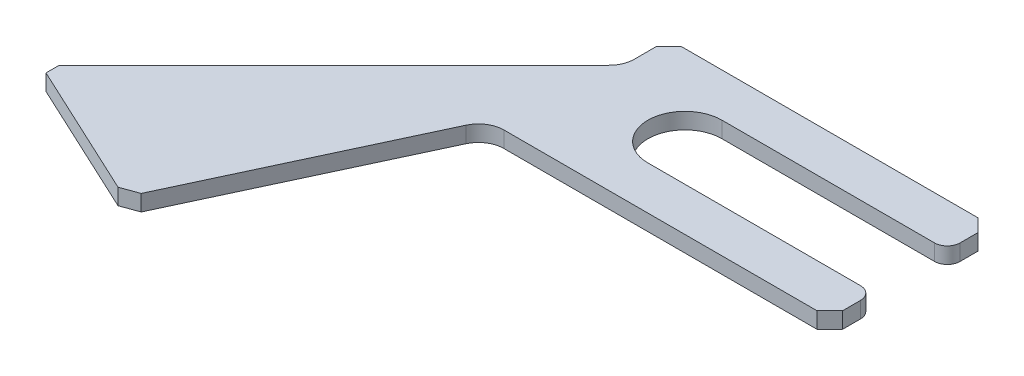
ISO-10303-21;
HEADER;
FILE_DESCRIPTION(('STEP AP214'),'2;1');
FILE_NAME('part.step','',(''),(''),'','','');
FILE_SCHEMA(('AUTOMOTIVE_DESIGN { 1 0 10303 214 1 1 1 1 }'));
ENDSEC;
DATA;
#1=APPLICATION_CONTEXT('core data for automotive mechanical design processes');
#2=APPLICATION_PROTOCOL_DEFINITION('international standard','automotive_design',2000,#1);
#3=PRODUCT_CONTEXT('',#1,'mechanical');
#4=PRODUCT('Part','Part','',(#3));
#5=PRODUCT_RELATED_PRODUCT_CATEGORY('part','',(#4));
#6=PRODUCT_DEFINITION_FORMATION('','',#4);
#7=PRODUCT_DEFINITION_CONTEXT('part definition',#1,'design');
#8=PRODUCT_DEFINITION('design','',#6,#7);
#9=PRODUCT_DEFINITION_SHAPE('','',#8);
#10=(LENGTH_UNIT() NAMED_UNIT(*) SI_UNIT(.MILLI.,.METRE.));
#11=(NAMED_UNIT(*) PLANE_ANGLE_UNIT() SI_UNIT($,.RADIAN.));
#12=(NAMED_UNIT(*) SI_UNIT($,.STERADIAN.) SOLID_ANGLE_UNIT());
#13=UNCERTAINTY_MEASURE_WITH_UNIT(LENGTH_MEASURE(1.E-05),#10,'distance_accuracy_value','');
#14=(GEOMETRIC_REPRESENTATION_CONTEXT(3) GLOBAL_UNCERTAINTY_ASSIGNED_CONTEXT((#13)) GLOBAL_UNIT_ASSIGNED_CONTEXT((#10,
#11,#12)) REPRESENTATION_CONTEXT('',''));
#15=CARTESIAN_POINT('',(0.,0.,0.));
#16=DIRECTION('',(0.,0.,1.));
#17=DIRECTION('',(1.,0.,0.));
#18=AXIS2_PLACEMENT_3D('',#15,#16,#17);
#19=CARTESIAN_POINT('',(9.99999999999994,1.,5.));
#20=DIRECTION('',(-1.,0.,0.));
#21=DIRECTION('',(0.,0.,1.));
#22=AXIS2_PLACEMENT_3D('',#19,#20,#21);
#23=PLANE('',#22);
#24=DIRECTION('',(0.,0.,-1.));
#25=VECTOR('',#24,1.);
#26=CARTESIAN_POINT('',(9.99999999999994,0.,5.));
#27=LINE('',#26,#25);
#28=CARTESIAN_POINT('',(9.99999999999994,0.,-3.09375));
#29=VERTEX_POINT('',#28);
#30=CARTESIAN_POINT('',(9.99999999999994,0.,-4.20625));
#31=VERTEX_POINT('',#30);
#32=EDGE_CURVE('E207',#29,#31,#27,.T.);
#33=ORIENTED_EDGE('',*,*,#32,.T.);
#34=DIRECTION('',(0.,1.,0.));
#35=VECTOR('',#34,1.);
#36=CARTESIAN_POINT('',(9.99999999999994,1.,-4.20625));
#37=LINE('',#36,#35);
#38=CARTESIAN_POINT('',(9.99999999999994,1.,-4.20625));
#39=VERTEX_POINT('',#38);
#40=EDGE_CURVE('E317',#31,#39,#37,.T.);
#41=ORIENTED_EDGE('',*,*,#40,.T.);
#42=DIRECTION('',(0.,0.,-1.));
#43=VECTOR('',#42,1.);
#44=CARTESIAN_POINT('',(9.99999999999994,1.,5.));
#45=LINE('',#44,#43);
#46=CARTESIAN_POINT('',(9.99999999999994,1.,-3.09375));
#47=VERTEX_POINT('',#46);
#48=EDGE_CURVE('E212',#47,#39,#45,.T.);
#49=ORIENTED_EDGE('',*,*,#48,.F.);
#50=DIRECTION('',(0.,1.,0.));
#51=VECTOR('',#50,1.);
#52=CARTESIAN_POINT('',(9.99999999999994,1.,-3.09375));
#53=LINE('',#52,#51);
#54=EDGE_CURVE('E278',#47,#29,#53,.F.);
#55=ORIENTED_EDGE('',*,*,#54,.T.);
#56=EDGE_LOOP('',(#33,#41,#49,#55));
#57=FACE_BOUND('',#56,.T.);
#58=ADVANCED_FACE('F34',(#57),#23,.F.);
#59=CARTESIAN_POINT('',(9.99999999999994,1.,4.20624999999999));
#60=VERTEX_POINT('',#59);
#61=CARTESIAN_POINT('',(9.99999999999994,1.,3.09375));
#62=VERTEX_POINT('',#61);
#63=EDGE_CURVE('E209',#60,#62,#45,.T.);
#64=ORIENTED_EDGE('',*,*,#63,.F.);
#65=DIRECTION('',(0.,-1.,0.));
#66=VECTOR('',#65,1.);
#67=CARTESIAN_POINT('',(9.99999999999994,1.,4.20624999999999));
#68=LINE('',#67,#66);
#69=CARTESIAN_POINT('',(9.99999999999994,0.,4.20624999999999));
#70=VERTEX_POINT('',#69);
#71=EDGE_CURVE('E42',#60,#70,#68,.T.);
#72=ORIENTED_EDGE('',*,*,#71,.T.);
#73=CARTESIAN_POINT('',(9.99999999999994,0.,3.09375));
#74=VERTEX_POINT('',#73);
#75=EDGE_CURVE('E231',#70,#74,#27,.T.);
#76=ORIENTED_EDGE('',*,*,#75,.T.);
#77=DIRECTION('',(0.,1.,0.));
#78=VECTOR('',#77,1.);
#79=CARTESIAN_POINT('',(9.99999999999994,1.,3.09375));
#80=LINE('',#79,#78);
#81=EDGE_CURVE('E263',#74,#62,#80,.T.);
#82=ORIENTED_EDGE('',*,*,#81,.T.);
#83=EDGE_LOOP('',(#64,#72,#76,#82));
#84=FACE_BOUND('',#83,.T.);
#85=ADVANCED_FACE('F323',(#84),#23,.F.);
#86=CARTESIAN_POINT('',(-10.0000000000001,1.,-5.));
#87=DIRECTION('',(0.,0.,1.));
#88=DIRECTION('',(1.,0.,0.));
#89=AXIS2_PLACEMENT_3D('',#86,#87,#88);
#90=PLANE('',#89);
#91=DIRECTION('',(-1.,0.,0.));
#92=VECTOR('',#91,1.);
#93=CARTESIAN_POINT('',(-10.0000000000001,0.,-5.));
#94=LINE('',#93,#92);
#95=CARTESIAN_POINT('',(9.20624999999993,0.,-5.00000000000001));
#96=VERTEX_POINT('',#95);
#97=CARTESIAN_POINT('',(-9.20625000000006,0.,-5.));
#98=VERTEX_POINT('',#97);
#99=EDGE_CURVE('E233',#96,#98,#94,.T.);
#100=ORIENTED_EDGE('',*,*,#99,.T.);
#101=DIRECTION('',(0.,1.,0.));
#102=VECTOR('',#101,1.);
#103=CARTESIAN_POINT('',(-9.20625000000006,1.,-5.));
#104=LINE('',#103,#102);
#105=CARTESIAN_POINT('',(-9.20625000000006,1.,-5.));
#106=VERTEX_POINT('',#105);
#107=EDGE_CURVE('E315',#98,#106,#104,.T.);
#108=ORIENTED_EDGE('',*,*,#107,.T.);
#109=DIRECTION('',(-1.,0.,0.));
#110=VECTOR('',#109,1.);
#111=CARTESIAN_POINT('',(-10.0000000000001,1.,-5.));
#112=LINE('',#111,#110);
#113=CARTESIAN_POINT('',(9.20624999999993,1.,-5.00000000000001));
#114=VERTEX_POINT('',#113);
#115=EDGE_CURVE('E211',#114,#106,#112,.T.);
#116=ORIENTED_EDGE('',*,*,#115,.F.);
#117=DIRECTION('',(0.,-1.,0.));
#118=VECTOR('',#117,1.);
#119=CARTESIAN_POINT('',(9.20624999999994,1.,-5.));
#120=LINE('',#119,#118);
#121=EDGE_CURVE('E312',#114,#96,#120,.T.);
#122=ORIENTED_EDGE('',*,*,#121,.T.);
#123=EDGE_LOOP('',(#100,#108,#116,#122));
#124=FACE_BOUND('',#123,.T.);
#125=ADVANCED_FACE('F345',(#124),#90,.F.);
#126=CARTESIAN_POINT('',(-10.0000000000001,1.,-2.86501184166654));
#127=DIRECTION('',(1.,0.,0.));
#128=DIRECTION('',(0.,0.,-1.));
#129=AXIS2_PLACEMENT_3D('',#126,#127,#128);
#130=PLANE('',#129);
#131=DIRECTION('',(0.,0.,1.));
#132=VECTOR('',#131,1.);
#133=CARTESIAN_POINT('',(-10.0000000000001,1.,-2.86501184166654));
#134=LINE('',#133,#132);
#135=CARTESIAN_POINT('',(-10.0000000000001,1.,-4.20625000000001));
#136=VERTEX_POINT('',#135);
#137=CARTESIAN_POINT('',(-10.0000000000001,1.,-2.86501184166654));
#138=VERTEX_POINT('',#137);
#139=EDGE_CURVE('E215',#136,#138,#134,.T.);
#140=ORIENTED_EDGE('',*,*,#139,.F.);
#141=DIRECTION('',(0.,-1.,0.));
#142=VECTOR('',#141,1.);
#143=CARTESIAN_POINT('',(-10.0000000000001,1.,-4.20625000000001));
#144=LINE('',#143,#142);
#145=CARTESIAN_POINT('',(-10.0000000000001,0.,-4.20625000000001));
#146=VERTEX_POINT('',#145);
#147=EDGE_CURVE('E309',#136,#146,#144,.T.);
#148=ORIENTED_EDGE('',*,*,#147,.T.);
#149=DIRECTION('',(0.,0.,1.));
#150=VECTOR('',#149,1.);
#151=CARTESIAN_POINT('',(-10.0000000000001,0.,-2.86501184166654));
#152=LINE('',#151,#150);
#153=CARTESIAN_POINT('',(-10.0000000000001,0.,-2.86501184166654));
#154=VERTEX_POINT('',#153);
#155=EDGE_CURVE('E236',#146,#154,#152,.T.);
#156=ORIENTED_EDGE('',*,*,#155,.T.);
#157=DIRECTION('',(0.,-1.,0.));
#158=VECTOR('',#157,1.);
#159=CARTESIAN_POINT('',(-10.0000000000001,1.,-2.86501184166654));
#160=LINE('',#159,#158);
#161=EDGE_CURVE('E260',#138,#154,#160,.T.);
#162=ORIENTED_EDGE('',*,*,#161,.F.);
#163=EDGE_LOOP('',(#140,#148,#156,#162));
#164=FACE_BOUND('',#163,.T.);
#165=ADVANCED_FACE('F375',(#164),#130,.F.);
#166=CARTESIAN_POINT('',(-11.5875000000001,1.,-2.86501184166654));
#167=DIRECTION('',(0.,-1.,0.));
#168=DIRECTION('',(0.,0.,-1.));
#169=AXIS2_PLACEMENT_3D('',#166,#167,#168);
#170=CYLINDRICAL_SURFACE('',#169,1.5875);
#171=CARTESIAN_POINT('',(-11.5875000000001,0.,-2.86501184166654));
#172=DIRECTION('',(0.,-1.,0.));
#173=DIRECTION('',(0.,0.,-1.));
#174=AXIS2_PLACEMENT_3D('',#171,#172,#173);
#175=CIRCLE('',#174,1.5875);
#176=CARTESIAN_POINT('',(-10.4649679848664,0.,-1.7424798265329));
#177=VERTEX_POINT('',#176);
#178=EDGE_CURVE('E238',#154,#177,#175,.T.);
#179=ORIENTED_EDGE('',*,*,#178,.T.);
#180=DIRECTION('',(0.,-1.,0.));
#181=VECTOR('',#180,1.);
#182=CARTESIAN_POINT('',(-10.4649679848664,1.,-1.7424798265329));
#183=LINE('',#182,#181);
#184=CARTESIAN_POINT('',(-10.4649679848664,1.,-1.7424798265329));
#185=VERTEX_POINT('',#184);
#186=EDGE_CURVE('E257',#185,#177,#183,.T.);
#187=ORIENTED_EDGE('',*,*,#186,.F.);
#188=CARTESIAN_POINT('',(-11.5875000000001,1.,-2.86501184166654));
#189=DIRECTION('',(0.,-1.,0.));
#190=DIRECTION('',(0.,0.,-1.));
#191=AXIS2_PLACEMENT_3D('',#188,#189,#190);
#192=CIRCLE('',#191,1.5875);
#193=EDGE_CURVE('E217',#138,#185,#192,.T.);
#194=ORIENTED_EDGE('',*,*,#193,.F.);
#195=ORIENTED_EDGE('',*,*,#161,.T.);
#196=EDGE_LOOP('',(#179,#187,#194,#195));
#197=FACE_BOUND('',#196,.T.);
#198=ADVANCED_FACE('F381',(#197),#170,.F.);
#199=CARTESIAN_POINT('',(-28.1000000000001,1.,15.8925521886008));
#200=DIRECTION('',(0.707106781186549,0.,0.707106781186546));
#201=DIRECTION('',(0.707106781186546,0.,-0.707106781186549));
#202=AXIS2_PLACEMENT_3D('',#199,#200,#201);
#203=PLANE('',#202);
#204=DIRECTION('',(-0.707106781186546,0.,0.707106781186549));
#205=VECTOR('',#204,1.);
#206=CARTESIAN_POINT('',(-28.1000000000001,0.,15.8925521886008));
#207=LINE('',#206,#205);
#208=CARTESIAN_POINT('',(-27.5387339924332,0.,15.331286181034));
#209=VERTEX_POINT('',#208);
#210=EDGE_CURVE('E240',#177,#209,#207,.T.);
#211=ORIENTED_EDGE('',*,*,#210,.T.);
#212=DIRECTION('',(0.,1.,0.));
#213=VECTOR('',#212,1.);
#214=CARTESIAN_POINT('',(-27.5387339924332,1.,15.331286181034));
#215=LINE('',#214,#213);
#216=CARTESIAN_POINT('',(-27.5387339924332,1.,15.331286181034));
#217=VERTEX_POINT('',#216);
#218=EDGE_CURVE('E295',#209,#217,#215,.T.);
#219=ORIENTED_EDGE('',*,*,#218,.T.);
#220=DIRECTION('',(-0.707106781186546,0.,0.707106781186549));
#221=VECTOR('',#220,1.);
#222=CARTESIAN_POINT('',(-28.1000000000001,1.,15.8925521886008));
#223=LINE('',#222,#221);
#224=EDGE_CURVE('E219',#185,#217,#223,.T.);
#225=ORIENTED_EDGE('',*,*,#224,.F.);
#226=ORIENTED_EDGE('',*,*,#186,.T.);
#227=EDGE_LOOP('',(#211,#219,#225,#226));
#228=FACE_BOUND('',#227,.T.);
#229=ADVANCED_FACE('F417',(#228),#203,.F.);
#230=CARTESIAN_POINT('',(-18.433746974619,1.,20.4));
#231=DIRECTION('',(0.422618261740703,0.,-0.906307787036648));
#232=DIRECTION('',(-0.906307787036648,0.,-0.422618261740703));
#233=AXIS2_PLACEMENT_3D('',#230,#231,#232);
#234=PLANE('',#233);
#235=DIRECTION('',(0.906307787036648,0.,0.422618261740703));
#236=VECTOR('',#235,1.);
#237=CARTESIAN_POINT('',(-18.433746974619,1.,20.4));
#238=LINE('',#237,#236);
#239=CARTESIAN_POINT('',(-27.5387339924332,1.,16.1542748261913));
#240=VERTEX_POINT('',#239);
#241=CARTESIAN_POINT('',(-19.1531287805793,1.,20.0645467547433));
#242=VERTEX_POINT('',#241);
#243=EDGE_CURVE('E222',#240,#242,#238,.T.);
#244=ORIENTED_EDGE('',*,*,#243,.F.);
#245=DIRECTION('',(0.,-1.,0.));
#246=VECTOR('',#245,1.);
#247=CARTESIAN_POINT('',(-27.5387339924332,1.,16.1542748261913));
#248=LINE('',#247,#246);
#249=CARTESIAN_POINT('',(-27.5387339924332,0.,16.1542748261913));
#250=VERTEX_POINT('',#249);
#251=EDGE_CURVE('E282',#240,#250,#248,.T.);
#252=ORIENTED_EDGE('',*,*,#251,.T.);
#253=DIRECTION('',(0.906307787036648,0.,0.422618261740703));
#254=VECTOR('',#253,1.);
#255=CARTESIAN_POINT('',(-18.433746974619,0.,20.4));
#256=LINE('',#255,#254);
#257=CARTESIAN_POINT('',(-19.1531287805793,0.,20.0645467547433));
#258=VERTEX_POINT('',#257);
#259=EDGE_CURVE('E243',#250,#258,#256,.T.);
#260=ORIENTED_EDGE('',*,*,#259,.T.);
#261=DIRECTION('',(0.,1.,0.));
#262=VECTOR('',#261,1.);
#263=CARTESIAN_POINT('',(-19.1531287805793,1.,20.0645467547433));
#264=LINE('',#263,#262);
#265=EDGE_CURVE('E280',#258,#242,#264,.T.);
#266=ORIENTED_EDGE('',*,*,#265,.T.);
#267=EDGE_LOOP('',(#244,#252,#260,#266));
#268=FACE_BOUND('',#267,.T.);
#269=ADVANCED_FACE('F389',(#268),#234,.F.);
#270=CARTESIAN_POINT('',(-11.6800236119207,1.,5.91659350948663));
#271=DIRECTION('',(-0.906307787036648,0.,-0.422618261740703));
#272=DIRECTION('',(-0.422618261740703,0.,0.906307787036648));
#273=AXIS2_PLACEMENT_3D('',#270,#271,#272);
#274=PLANE('',#273);
#275=DIRECTION('',(0.422618261740703,0.,-0.906307787036648));
#276=VECTOR('',#275,1.);
#277=CARTESIAN_POINT('',(-11.6800236119207,1.,5.91659350948663));
#278=LINE('',#277,#276);
#279=CARTESIAN_POINT('',(-18.0982937293623,1.,19.6806181940396));
#280=VERTEX_POINT('',#279);
#281=CARTESIAN_POINT('',(-11.6800236119207,1.,5.91659350948663));
#282=VERTEX_POINT('',#281);
#283=EDGE_CURVE('E224',#280,#282,#278,.T.);
#284=ORIENTED_EDGE('',*,*,#283,.F.);
#285=DIRECTION('',(0.,-1.,0.));
#286=VECTOR('',#285,1.);
#287=CARTESIAN_POINT('',(-18.0982937293623,1.,19.6806181940396));
#288=LINE('',#287,#286);
#289=CARTESIAN_POINT('',(-18.0982937293623,0.,19.6806181940397));
#290=VERTEX_POINT('',#289);
#291=EDGE_CURVE('E306',#280,#290,#288,.T.);
#292=ORIENTED_EDGE('',*,*,#291,.T.);
#293=DIRECTION('',(0.422618261740703,0.,-0.906307787036648));
#294=VECTOR('',#293,1.);
#295=CARTESIAN_POINT('',(-11.6800236119207,0.,5.91659350948663));
#296=LINE('',#295,#294);
#297=CARTESIAN_POINT('',(-11.6800236119207,0.,5.91659350948663));
#298=VERTEX_POINT('',#297);
#299=EDGE_CURVE('E246',#290,#298,#296,.T.);
#300=ORIENTED_EDGE('',*,*,#299,.T.);
#301=DIRECTION('',(0.,-1.,0.));
#302=VECTOR('',#301,1.);
#303=CARTESIAN_POINT('',(-11.6800236119207,1.,5.91659350948663));
#304=LINE('',#303,#302);
#305=EDGE_CURVE('E254',#282,#298,#304,.T.);
#306=ORIENTED_EDGE('',*,*,#305,.F.);
#307=EDGE_LOOP('',(#284,#292,#300,#306));
#308=FACE_BOUND('',#307,.T.);
#309=ADVANCED_FACE('F396',(#308),#274,.F.);
#310=CARTESIAN_POINT('',(-10.2412600000001,1.,6.5875));
#311=DIRECTION('',(0.,-1.,0.));
#312=DIRECTION('',(0.,0.,-1.));
#313=AXIS2_PLACEMENT_3D('',#310,#311,#312);
#314=CYLINDRICAL_SURFACE('',#313,1.5875);
#315=CARTESIAN_POINT('',(-10.2412600000001,0.,6.5875));
#316=DIRECTION('',(0.,-1.,0.));
#317=DIRECTION('',(0.,0.,-1.));
#318=AXIS2_PLACEMENT_3D('',#315,#316,#317);
#319=CIRCLE('',#318,1.5875);
#320=CARTESIAN_POINT('',(-10.2412600000001,0.,5.));
#321=VERTEX_POINT('',#320);
#322=EDGE_CURVE('E248',#298,#321,#319,.T.);
#323=ORIENTED_EDGE('',*,*,#322,.T.);
#324=DIRECTION('',(0.,-1.,0.));
#325=VECTOR('',#324,1.);
#326=CARTESIAN_POINT('',(-10.2412600000001,1.,5.));
#327=LINE('',#326,#325);
#328=CARTESIAN_POINT('',(-10.2412600000001,1.,5.));
#329=VERTEX_POINT('',#328);
#330=EDGE_CURVE('E230',#329,#321,#327,.T.);
#331=ORIENTED_EDGE('',*,*,#330,.F.);
#332=CARTESIAN_POINT('',(-10.2412600000001,1.,6.5875));
#333=DIRECTION('',(0.,-1.,0.));
#334=DIRECTION('',(0.,0.,-1.));
#335=AXIS2_PLACEMENT_3D('',#332,#333,#334);
#336=CIRCLE('',#335,1.5875);
#337=EDGE_CURVE('E226',#282,#329,#336,.T.);
#338=ORIENTED_EDGE('',*,*,#337,.F.);
#339=ORIENTED_EDGE('',*,*,#305,.T.);
#340=EDGE_LOOP('',(#323,#331,#338,#339));
#341=FACE_BOUND('',#340,.T.);
#342=ADVANCED_FACE('F401',(#341),#314,.F.);
#343=CARTESIAN_POINT('',(-10.2412600000001,1.,5.));
#344=DIRECTION('',(0.,0.,-1.));
#345=DIRECTION('',(-1.,0.,0.));
#346=AXIS2_PLACEMENT_3D('',#343,#344,#345);
#347=PLANE('',#346);
#348=DIRECTION('',(1.,0.,0.));
#349=VECTOR('',#348,1.);
#350=CARTESIAN_POINT('',(-10.2412600000001,0.,5.));
#351=LINE('',#350,#349);
#352=CARTESIAN_POINT('',(9.20624999999994,0.,5.));
#353=VERTEX_POINT('',#352);
#354=EDGE_CURVE('E250',#321,#353,#351,.T.);
#355=ORIENTED_EDGE('',*,*,#354,.T.);
#356=DIRECTION('',(0.,1.,0.));
#357=VECTOR('',#356,1.);
#358=CARTESIAN_POINT('',(9.20624999999994,1.,5.));
#359=LINE('',#358,#357);
#360=CARTESIAN_POINT('',(9.20624999999993,1.,5.));
#361=VERTEX_POINT('',#360);
#362=EDGE_CURVE('E11',#353,#361,#359,.T.);
#363=ORIENTED_EDGE('',*,*,#362,.T.);
#364=DIRECTION('',(1.,0.,0.));
#365=VECTOR('',#364,1.);
#366=CARTESIAN_POINT('',(-10.2412600000001,1.,5.));
#367=LINE('',#366,#365);
#368=EDGE_CURVE('E228',#329,#361,#367,.T.);
#369=ORIENTED_EDGE('',*,*,#368,.F.);
#370=ORIENTED_EDGE('',*,*,#330,.T.);
#371=EDGE_LOOP('',(#355,#363,#369,#370));
#372=FACE_BOUND('',#371,.T.);
#373=ADVANCED_FACE('F402',(#372),#347,.F.);
#374=CARTESIAN_POINT('',(-11.5875000000001,1.,-2.86501184166654));
#375=DIRECTION('',(0.,-1.,0.));
#376=DIRECTION('',(0.,0.,-1.));
#377=AXIS2_PLACEMENT_3D('',#374,#375,#376);
#378=PLANE('',#377);
#379=ORIENTED_EDGE('',*,*,#224,.T.);
#380=DIRECTION('',(0.,0.,-1.));
#381=VECTOR('',#380,1.);
#382=CARTESIAN_POINT('',(-27.5387339924332,1.,16.1542748261913));
#383=LINE('',#382,#381);
#384=EDGE_CURVE('E304',#217,#240,#383,.F.);
#385=ORIENTED_EDGE('',*,*,#384,.T.);
#386=ORIENTED_EDGE('',*,*,#243,.T.);
#387=DIRECTION('',(-0.93969262078591,0.,0.342020143325664));
#388=VECTOR('',#387,1.);
#389=CARTESIAN_POINT('',(-18.0982937293623,1.,19.6806181940396));
#390=LINE('',#389,#388);
#391=EDGE_CURVE('E55',#242,#280,#390,.F.);
#392=ORIENTED_EDGE('',*,*,#391,.T.);
#393=ORIENTED_EDGE('',*,*,#283,.T.);
#394=ORIENTED_EDGE('',*,*,#337,.T.);
#395=ORIENTED_EDGE('',*,*,#368,.T.);
#396=DIRECTION('',(-0.707106781186548,0.,0.707106781186548));
#397=VECTOR('',#396,1.);
#398=CARTESIAN_POINT('',(9.99999999999994,1.,4.20624999999999));
#399=LINE('',#398,#397);
#400=EDGE_CURVE('E297',#361,#60,#399,.F.);
#401=ORIENTED_EDGE('',*,*,#400,.T.);
#402=ORIENTED_EDGE('',*,*,#63,.T.);
#403=CARTESIAN_POINT('',(9.20624999999994,1.,3.09375));
#404=DIRECTION('',(0.,-1.,0.));
#405=DIRECTION('',(0.,0.,-1.));
#406=AXIS2_PLACEMENT_3D('',#403,#404,#405);
#407=CIRCLE('',#406,0.79375);
#408=CARTESIAN_POINT('',(9.20624999999994,1.,2.3));
#409=VERTEX_POINT('',#408);
#410=EDGE_CURVE('E268',#62,#409,#407,.F.);
#411=ORIENTED_EDGE('',*,*,#410,.T.);
#412=DIRECTION('',(1.,0.,0.));
#413=VECTOR('',#412,1.);
#414=CARTESIAN_POINT('',(-3.99999994000006,1.,2.3));
#415=LINE('',#414,#413);
#416=CARTESIAN_POINT('',(-3.99999994000006,1.,2.3));
#417=VERTEX_POINT('',#416);
#418=EDGE_CURVE('E201',#417,#409,#415,.T.);
#419=ORIENTED_EDGE('',*,*,#418,.F.);
#420=CARTESIAN_POINT('',(-3.99999994000006,1.,0.));
#421=DIRECTION('',(0.,1.,0.));
#422=DIRECTION('',(0.,0.,1.));
#423=AXIS2_PLACEMENT_3D('',#420,#421,#422);
#424=CIRCLE('',#423,2.3);
#425=CARTESIAN_POINT('',(-3.99999994000006,1.,-2.3));
#426=VERTEX_POINT('',#425);
#427=EDGE_CURVE('E179',#426,#417,#424,.T.);
#428=ORIENTED_EDGE('',*,*,#427,.F.);
#429=DIRECTION('',(-1.,0.,0.));
#430=VECTOR('',#429,1.);
#431=CARTESIAN_POINT('',(-3.99999994000006,1.,-2.3));
#432=LINE('',#431,#430);
#433=CARTESIAN_POINT('',(9.20624999999994,1.,-2.3));
#434=VERTEX_POINT('',#433);
#435=EDGE_CURVE('E199',#434,#426,#432,.T.);
#436=ORIENTED_EDGE('',*,*,#435,.F.);
#437=CARTESIAN_POINT('',(9.20624999999994,1.,-3.09375));
#438=DIRECTION('',(0.,-1.,0.));
#439=DIRECTION('',(0.,0.,-1.));
#440=AXIS2_PLACEMENT_3D('',#437,#438,#439);
#441=CIRCLE('',#440,0.79375);
#442=EDGE_CURVE('E266',#434,#47,#441,.F.);
#443=ORIENTED_EDGE('',*,*,#442,.T.);
#444=ORIENTED_EDGE('',*,*,#48,.T.);
#445=DIRECTION('',(0.707106781186548,0.,0.707106781186548));
#446=VECTOR('',#445,1.);
#447=CARTESIAN_POINT('',(9.20624999999994,1.,-5.));
#448=LINE('',#447,#446);
#449=EDGE_CURVE('E299',#39,#114,#448,.F.);
#450=ORIENTED_EDGE('',*,*,#449,.T.);
#451=ORIENTED_EDGE('',*,*,#115,.T.);
#452=DIRECTION('',(0.707106781186548,0.,-0.707106781186548));
#453=VECTOR('',#452,1.);
#454=CARTESIAN_POINT('',(-10.0000000000001,1.,-4.20625000000001));
#455=LINE('',#454,#453);
#456=EDGE_CURVE('E301',#106,#136,#455,.F.);
#457=ORIENTED_EDGE('',*,*,#456,.T.);
#458=ORIENTED_EDGE('',*,*,#139,.T.);
#459=ORIENTED_EDGE('',*,*,#193,.T.);
#460=EDGE_LOOP('',(#379,#385,#386,#392,#393,#394,#395,#401,#402,#411,#419,#428,#436,#443,#444,
#450,#451,#457,#458,#459));
#461=FACE_BOUND('',#460,.T.);
#462=ADVANCED_FACE('F331',(#461),#378,.F.);
#463=CARTESIAN_POINT('',(-11.5875000000001,0.,-2.86501184166654));
#464=DIRECTION('',(0.,-1.,0.));
#465=DIRECTION('',(0.,0.,-1.));
#466=AXIS2_PLACEMENT_3D('',#463,#464,#465);
#467=PLANE('',#466);
#468=ORIENTED_EDGE('',*,*,#259,.F.);
#469=DIRECTION('',(0.,0.,1.));
#470=VECTOR('',#469,1.);
#471=CARTESIAN_POINT('',(-27.5387339924332,0.,-2.8650118416666));
#472=LINE('',#471,#470);
#473=EDGE_CURVE('E293',#250,#209,#472,.F.);
#474=ORIENTED_EDGE('',*,*,#473,.T.);
#475=ORIENTED_EDGE('',*,*,#210,.F.);
#476=ORIENTED_EDGE('',*,*,#178,.F.);
#477=ORIENTED_EDGE('',*,*,#155,.F.);
#478=DIRECTION('',(-0.707106781186548,0.,0.707106781186548));
#479=VECTOR('',#478,1.);
#480=CARTESIAN_POINT('',(-11.4643690791668,0.,-2.74188092083327));
#481=LINE('',#480,#479);
#482=EDGE_CURVE('E289',#146,#98,#481,.F.);
#483=ORIENTED_EDGE('',*,*,#482,.T.);
#484=ORIENTED_EDGE('',*,*,#99,.F.);
#485=DIRECTION('',(-0.707106781186548,0.,-0.707106781186548));
#486=VECTOR('',#485,1.);
#487=CARTESIAN_POINT('',(-0.123130920833325,0.,-14.3293809208333));
#488=LINE('',#487,#486);
#489=EDGE_CURVE('E287',#96,#31,#488,.F.);
#490=ORIENTED_EDGE('',*,*,#489,.T.);
#491=ORIENTED_EDGE('',*,*,#32,.F.);
#492=CARTESIAN_POINT('',(9.20624999999994,0.,-3.09375));
#493=DIRECTION('',(0.,-1.,0.));
#494=DIRECTION('',(0.,0.,-1.));
#495=AXIS2_PLACEMENT_3D('',#492,#493,#494);
#496=CIRCLE('',#495,0.79375);
#497=CARTESIAN_POINT('',(9.20624999999994,0.,-2.3));
#498=VERTEX_POINT('',#497);
#499=EDGE_CURVE('E271',#29,#498,#496,.T.);
#500=ORIENTED_EDGE('',*,*,#499,.T.);
#501=DIRECTION('',(-1.,0.,0.));
#502=VECTOR('',#501,1.);
#503=CARTESIAN_POINT('',(-3.99999994000006,0.,-2.3));
#504=LINE('',#503,#502);
#505=CARTESIAN_POINT('',(-3.99999994000006,0.,-2.3));
#506=VERTEX_POINT('',#505);
#507=EDGE_CURVE('E184',#498,#506,#504,.T.);
#508=ORIENTED_EDGE('',*,*,#507,.T.);
#509=CARTESIAN_POINT('',(-3.99999994000006,0.,0.));
#510=DIRECTION('',(0.,1.,0.));
#511=DIRECTION('',(0.,0.,1.));
#512=AXIS2_PLACEMENT_3D('',#509,#510,#511);
#513=CIRCLE('',#512,2.3);
#514=CARTESIAN_POINT('',(-3.99999994000006,0.,2.3));
#515=VERTEX_POINT('',#514);
#516=EDGE_CURVE('E177',#506,#515,#513,.T.);
#517=ORIENTED_EDGE('',*,*,#516,.T.);
#518=DIRECTION('',(1.,0.,0.));
#519=VECTOR('',#518,1.);
#520=CARTESIAN_POINT('',(-3.99999994000006,0.,2.3));
#521=LINE('',#520,#519);
#522=CARTESIAN_POINT('',(9.20624999999994,0.,2.3));
#523=VERTEX_POINT('',#522);
#524=EDGE_CURVE('E187',#515,#523,#521,.T.);
#525=ORIENTED_EDGE('',*,*,#524,.T.);
#526=CARTESIAN_POINT('',(9.20624999999994,0.,3.09375));
#527=DIRECTION('',(0.,-1.,0.));
#528=DIRECTION('',(0.,0.,-1.));
#529=AXIS2_PLACEMENT_3D('',#526,#527,#528);
#530=CIRCLE('',#529,0.79375);
#531=EDGE_CURVE('E273',#523,#74,#530,.T.);
#532=ORIENTED_EDGE('',*,*,#531,.T.);
#533=ORIENTED_EDGE('',*,*,#75,.F.);
#534=DIRECTION('',(0.707106781186548,0.,-0.707106781186548));
#535=VECTOR('',#534,1.);
#536=CARTESIAN_POINT('',(2.74188092083321,0.,11.4643690791667));
#537=LINE('',#536,#535);
#538=EDGE_CURVE('E285',#70,#353,#537,.F.);
#539=ORIENTED_EDGE('',*,*,#538,.T.);
#540=ORIENTED_EDGE('',*,*,#354,.F.);
#541=ORIENTED_EDGE('',*,*,#322,.F.);
#542=ORIENTED_EDGE('',*,*,#299,.F.);
#543=DIRECTION('',(0.93969262078591,0.,-0.342020143325664));
#544=VECTOR('',#543,1.);
#545=CARTESIAN_POINT('',(-5.10309236658102,0.,14.9507517096917));
#546=LINE('',#545,#544);
#547=EDGE_CURVE('E291',#290,#258,#546,.F.);
#548=ORIENTED_EDGE('',*,*,#547,.T.);
#549=EDGE_LOOP('',(#468,#474,#475,#476,#477,#483,#484,#490,#491,#500,#508,#517,#525,#532,#533,
#539,#540,#541,#542,#548));
#550=FACE_BOUND('',#549,.T.);
#551=ADVANCED_FACE('F196',(#550),#467,.T.);
#552=CARTESIAN_POINT('',(-3.99999994000006,0.,0.));
#553=DIRECTION('',(0.,1.,0.));
#554=DIRECTION('',(0.,0.,1.));
#555=AXIS2_PLACEMENT_3D('',#552,#553,#554);
#556=CYLINDRICAL_SURFACE('',#555,2.3);
#557=ORIENTED_EDGE('',*,*,#427,.T.);
#558=DIRECTION('',(0.,1.,0.));
#559=VECTOR('',#558,1.);
#560=CARTESIAN_POINT('',(-3.99999994000006,0.,2.3));
#561=LINE('',#560,#559);
#562=EDGE_CURVE('E172',#515,#417,#561,.T.);
#563=ORIENTED_EDGE('',*,*,#562,.F.);
#564=ORIENTED_EDGE('',*,*,#516,.F.);
#565=DIRECTION('',(0.,1.,0.));
#566=VECTOR('',#565,1.);
#567=CARTESIAN_POINT('',(-3.99999994000006,0.,-2.3));
#568=LINE('',#567,#566);
#569=EDGE_CURVE('E183',#506,#426,#568,.T.);
#570=ORIENTED_EDGE('',*,*,#569,.T.);
#571=EDGE_LOOP('',(#557,#563,#564,#570));
#572=FACE_BOUND('',#571,.T.);
#573=ADVANCED_FACE('F174',(#572),#556,.F.);
#574=CARTESIAN_POINT('',(-3.99999994000006,0.,-2.3));
#575=DIRECTION('',(0.,0.,-1.));
#576=DIRECTION('',(-1.,0.,0.));
#577=AXIS2_PLACEMENT_3D('',#574,#575,#576);
#578=PLANE('',#577);
#579=ORIENTED_EDGE('',*,*,#507,.F.);
#580=DIRECTION('',(0.,1.,0.));
#581=VECTOR('',#580,1.);
#582=CARTESIAN_POINT('',(9.20624999999994,0.,-2.3));
#583=LINE('',#582,#581);
#584=EDGE_CURVE('E275',#498,#434,#583,.T.);
#585=ORIENTED_EDGE('',*,*,#584,.T.);
#586=ORIENTED_EDGE('',*,*,#435,.T.);
#587=ORIENTED_EDGE('',*,*,#569,.F.);
#588=EDGE_LOOP('',(#579,#585,#586,#587));
#589=FACE_BOUND('',#588,.T.);
#590=ADVANCED_FACE('F440',(#589),#578,.F.);
#591=CARTESIAN_POINT('',(-3.99999994000006,0.,2.3));
#592=DIRECTION('',(0.,0.,1.));
#593=DIRECTION('',(1.,0.,0.));
#594=AXIS2_PLACEMENT_3D('',#591,#592,#593);
#595=PLANE('',#594);
#596=ORIENTED_EDGE('',*,*,#418,.T.);
#597=DIRECTION('',(0.,1.,0.));
#598=VECTOR('',#597,1.);
#599=CARTESIAN_POINT('',(9.20624999999994,0.,2.3));
#600=LINE('',#599,#598);
#601=EDGE_CURVE('E190',#409,#523,#600,.F.);
#602=ORIENTED_EDGE('',*,*,#601,.T.);
#603=ORIENTED_EDGE('',*,*,#524,.F.);
#604=ORIENTED_EDGE('',*,*,#562,.T.);
#605=EDGE_LOOP('',(#596,#602,#603,#604));
#606=FACE_BOUND('',#605,.T.);
#607=ADVANCED_FACE('F188',(#606),#595,.F.);
#608=CARTESIAN_POINT('',(9.20624999999994,1.,3.09375));
#609=DIRECTION('',(0.,1.,0.));
#610=DIRECTION('',(0.,0.,1.));
#611=AXIS2_PLACEMENT_3D('',#608,#609,#610);
#612=CYLINDRICAL_SURFACE('',#611,0.79375);
#613=ORIENTED_EDGE('',*,*,#531,.F.);
#614=ORIENTED_EDGE('',*,*,#601,.F.);
#615=ORIENTED_EDGE('',*,*,#410,.F.);
#616=ORIENTED_EDGE('',*,*,#81,.F.);
#617=EDGE_LOOP('',(#613,#614,#615,#616));
#618=FACE_BOUND('',#617,.T.);
#619=ADVANCED_FACE('F330',(#618),#612,.T.);
#620=CARTESIAN_POINT('',(9.20624999999994,0.,-3.09375));
#621=DIRECTION('',(0.,1.,0.));
#622=DIRECTION('',(0.,0.,1.));
#623=AXIS2_PLACEMENT_3D('',#620,#621,#622);
#624=CYLINDRICAL_SURFACE('',#623,0.79375);
#625=ORIENTED_EDGE('',*,*,#499,.F.);
#626=ORIENTED_EDGE('',*,*,#54,.F.);
#627=ORIENTED_EDGE('',*,*,#442,.F.);
#628=ORIENTED_EDGE('',*,*,#584,.F.);
#629=EDGE_LOOP('',(#625,#626,#627,#628));
#630=FACE_BOUND('',#629,.T.);
#631=ADVANCED_FACE('F352',(#630),#624,.T.);
#632=CARTESIAN_POINT('',(-27.5387339924332,1.,16.1542748261913));
#633=DIRECTION('',(1.,0.,0.));
#634=DIRECTION('',(0.,-1.,0.));
#635=AXIS2_PLACEMENT_3D('',#632,#633,#634);
#636=PLANE('',#635);
#637=ORIENTED_EDGE('',*,*,#384,.F.);
#638=ORIENTED_EDGE('',*,*,#218,.F.);
#639=ORIENTED_EDGE('',*,*,#473,.F.);
#640=ORIENTED_EDGE('',*,*,#251,.F.);
#641=EDGE_LOOP('',(#637,#638,#639,#640));
#642=FACE_BOUND('',#641,.T.);
#643=ADVANCED_FACE('F355',(#642),#636,.F.);
#644=CARTESIAN_POINT('',(-18.0982937293623,1.,19.6806181940396));
#645=DIRECTION('',(-0.342020143325664,0.,-0.93969262078591));
#646=DIRECTION('',(0.,-1.,0.));
#647=AXIS2_PLACEMENT_3D('',#644,#645,#646);
#648=PLANE('',#647);
#649=ORIENTED_EDGE('',*,*,#391,.F.);
#650=ORIENTED_EDGE('',*,*,#265,.F.);
#651=ORIENTED_EDGE('',*,*,#547,.F.);
#652=ORIENTED_EDGE('',*,*,#291,.F.);
#653=EDGE_LOOP('',(#649,#650,#651,#652));
#654=FACE_BOUND('',#653,.T.);
#655=ADVANCED_FACE('F359',(#654),#648,.F.);
#656=CARTESIAN_POINT('',(-10.0000000000001,1.,-4.20625000000001));
#657=DIRECTION('',(0.707106781186548,0.,0.707106781186548));
#658=DIRECTION('',(0.,-1.,0.));
#659=AXIS2_PLACEMENT_3D('',#656,#657,#658);
#660=PLANE('',#659);
#661=ORIENTED_EDGE('',*,*,#456,.F.);
#662=ORIENTED_EDGE('',*,*,#107,.F.);
#663=ORIENTED_EDGE('',*,*,#482,.F.);
#664=ORIENTED_EDGE('',*,*,#147,.F.);
#665=EDGE_LOOP('',(#661,#662,#663,#664));
#666=FACE_BOUND('',#665,.T.);
#667=ADVANCED_FACE('F337',(#666),#660,.F.);
#668=CARTESIAN_POINT('',(9.20624999999994,1.,-5.));
#669=DIRECTION('',(-0.707106781186548,0.,0.707106781186548));
#670=DIRECTION('',(0.,-1.,0.));
#671=AXIS2_PLACEMENT_3D('',#668,#669,#670);
#672=PLANE('',#671);
#673=ORIENTED_EDGE('',*,*,#449,.F.);
#674=ORIENTED_EDGE('',*,*,#40,.F.);
#675=ORIENTED_EDGE('',*,*,#489,.F.);
#676=ORIENTED_EDGE('',*,*,#121,.F.);
#677=EDGE_LOOP('',(#673,#674,#675,#676));
#678=FACE_BOUND('',#677,.T.);
#679=ADVANCED_FACE('F333',(#678),#672,.F.);
#680=CARTESIAN_POINT('',(9.99999999999994,1.,4.20624999999999));
#681=DIRECTION('',(-0.707106781186548,0.,-0.707106781186548));
#682=DIRECTION('',(0.,-1.,0.));
#683=AXIS2_PLACEMENT_3D('',#680,#681,#682);
#684=PLANE('',#683);
#685=ORIENTED_EDGE('',*,*,#400,.F.);
#686=ORIENTED_EDGE('',*,*,#362,.F.);
#687=ORIENTED_EDGE('',*,*,#538,.F.);
#688=ORIENTED_EDGE('',*,*,#71,.F.);
#689=EDGE_LOOP('',(#685,#686,#687,#688));
#690=FACE_BOUND('',#689,.T.);
#691=ADVANCED_FACE('F36',(#690),#684,.F.);
#692=CLOSED_SHELL('',(#58,#85,#125,#165,#198,#229,#269,#309,#342,#373,#462,#551,#573,#590,#607,
#619,#631,#643,#655,#667,#679,#691));
#693=MANIFOLD_SOLID_BREP('B2',#692);
#694=ADVANCED_BREP_SHAPE_REPRESENTATION('',(#18,#693),#14);
#695=SHAPE_DEFINITION_REPRESENTATION(#9,#694);
ENDSEC;
END-ISO-10303-21;
